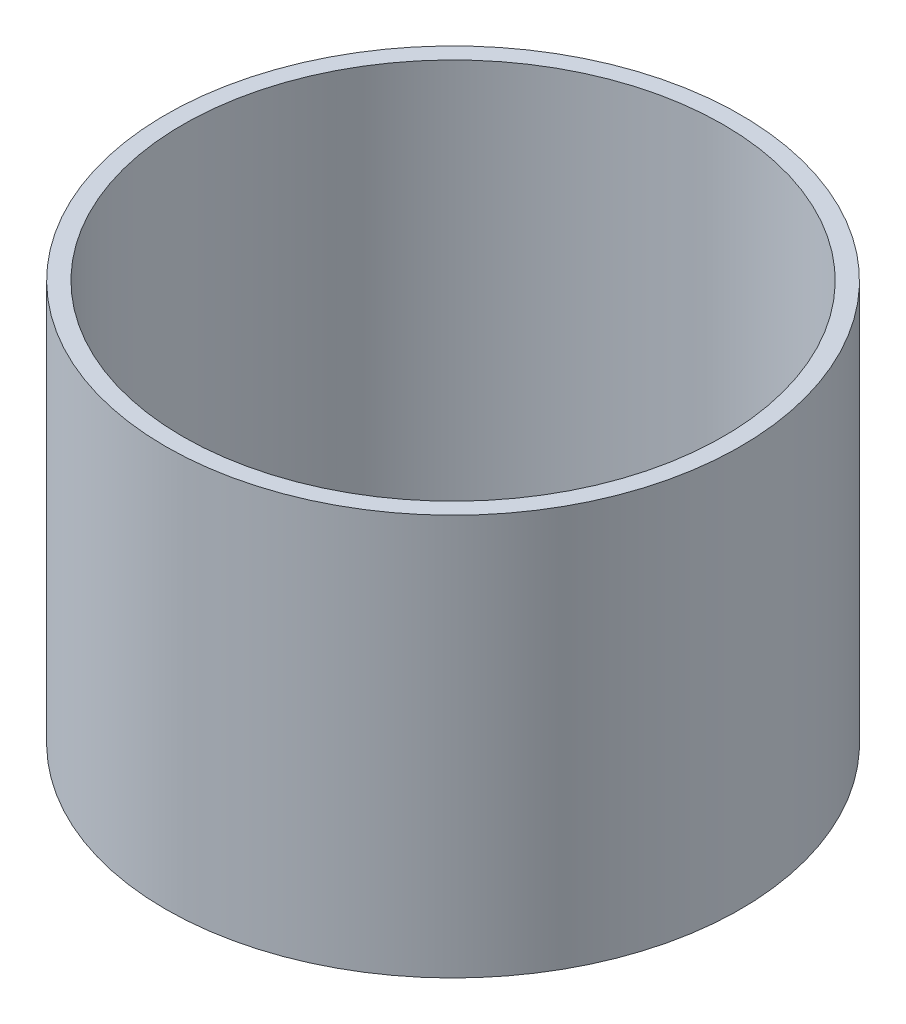
ISO-10303-21;
HEADER;
FILE_DESCRIPTION(('STEP AP214'),'2;1');
FILE_NAME('part.step','',(''),(''),'','','');
FILE_SCHEMA(('AUTOMOTIVE_DESIGN { 1 0 10303 214 1 1 1 1 }'));
ENDSEC;
DATA;
#1=APPLICATION_CONTEXT('core data for automotive mechanical design processes');
#2=APPLICATION_PROTOCOL_DEFINITION('international standard','automotive_design',2000,#1);
#3=PRODUCT_CONTEXT('',#1,'mechanical');
#4=PRODUCT('Part','Part','',(#3));
#5=PRODUCT_RELATED_PRODUCT_CATEGORY('part','',(#4));
#6=PRODUCT_DEFINITION_FORMATION('','',#4);
#7=PRODUCT_DEFINITION_CONTEXT('part definition',#1,'design');
#8=PRODUCT_DEFINITION('design','',#6,#7);
#9=PRODUCT_DEFINITION_SHAPE('','',#8);
#10=(LENGTH_UNIT() NAMED_UNIT(*) SI_UNIT(.MILLI.,.METRE.));
#11=(NAMED_UNIT(*) PLANE_ANGLE_UNIT() SI_UNIT($,.RADIAN.));
#12=(NAMED_UNIT(*) SI_UNIT($,.STERADIAN.) SOLID_ANGLE_UNIT());
#13=UNCERTAINTY_MEASURE_WITH_UNIT(LENGTH_MEASURE(1.E-05),#10,'distance_accuracy_value','');
#14=(GEOMETRIC_REPRESENTATION_CONTEXT(3) GLOBAL_UNCERTAINTY_ASSIGNED_CONTEXT((#13)) GLOBAL_UNIT_ASSIGNED_CONTEXT((#10,
#11,#12)) REPRESENTATION_CONTEXT('',''));
#15=CARTESIAN_POINT('',(0.,0.,0.));
#16=DIRECTION('',(0.,0.,1.));
#17=DIRECTION('',(1.,0.,0.));
#18=AXIS2_PLACEMENT_3D('',#15,#16,#17);
#19=CARTESIAN_POINT('',(0.,70.,0.));
#20=DIRECTION('',(0.,1.,0.));
#21=DIRECTION('',(0.,0.,1.));
#22=AXIS2_PLACEMENT_3D('',#19,#20,#21);
#23=PLANE('',#22);
#24=CARTESIAN_POINT('',(0.,70.,0.));
#25=DIRECTION('',(0.,1.,0.));
#26=DIRECTION('',(0.,0.,1.));
#27=AXIS2_PLACEMENT_3D('',#24,#25,#26);
#28=CIRCLE('',#27,50.2);
#29=CARTESIAN_POINT('',(0.,70.,50.2));
#30=VERTEX_POINT('',#29);
#31=EDGE_CURVE('E10',#30,#30,#28,.T.);
#32=ORIENTED_EDGE('',*,*,#31,.T.);
#33=EDGE_LOOP('',(#32));
#34=FACE_BOUND('',#33,.T.);
#35=CARTESIAN_POINT('',(0.,70.,0.));
#36=DIRECTION('',(0.,1.,0.));
#37=DIRECTION('',(0.,0.,1.));
#38=AXIS2_PLACEMENT_3D('',#35,#36,#37);
#39=CIRCLE('',#38,47.2);
#40=CARTESIAN_POINT('',(0.,70.,47.2));
#41=VERTEX_POINT('',#40);
#42=EDGE_CURVE('E50',#41,#41,#39,.T.);
#43=ORIENTED_EDGE('',*,*,#42,.F.);
#44=EDGE_LOOP('',(#43));
#45=FACE_BOUND('',#44,.T.);
#46=ADVANCED_FACE('F37',(#34,#45),#23,.T.);
#47=CARTESIAN_POINT('',(0.,0.,0.));
#48=DIRECTION('',(0.,1.,0.));
#49=DIRECTION('',(0.,0.,1.));
#50=AXIS2_PLACEMENT_3D('',#47,#48,#49);
#51=PLANE('',#50);
#52=CARTESIAN_POINT('',(0.,0.,0.));
#53=DIRECTION('',(0.,1.,0.));
#54=DIRECTION('',(0.,0.,1.));
#55=AXIS2_PLACEMENT_3D('',#52,#53,#54);
#56=CIRCLE('',#55,50.2);
#57=CARTESIAN_POINT('',(0.,0.,50.2));
#58=VERTEX_POINT('',#57);
#59=EDGE_CURVE('E41',#58,#58,#56,.T.);
#60=ORIENTED_EDGE('',*,*,#59,.F.);
#61=EDGE_LOOP('',(#60));
#62=FACE_BOUND('',#61,.T.);
#63=CARTESIAN_POINT('',(0.,0.,0.));
#64=DIRECTION('',(0.,1.,0.));
#65=DIRECTION('',(0.,0.,1.));
#66=AXIS2_PLACEMENT_3D('',#63,#64,#65);
#67=CIRCLE('',#66,47.2);
#68=CARTESIAN_POINT('',(0.,0.,47.2));
#69=VERTEX_POINT('',#68);
#70=EDGE_CURVE('E52',#69,#69,#67,.T.);
#71=ORIENTED_EDGE('',*,*,#70,.T.);
#72=EDGE_LOOP('',(#71));
#73=FACE_BOUND('',#72,.T.);
#74=ADVANCED_FACE('F64',(#62,#73),#51,.F.);
#75=CARTESIAN_POINT('',(0.,70.,0.));
#76=DIRECTION('',(0.,-1.,0.));
#77=DIRECTION('',(0.,0.,-1.));
#78=AXIS2_PLACEMENT_3D('',#75,#76,#77);
#79=CYLINDRICAL_SURFACE('',#78,50.2);
#80=ORIENTED_EDGE('',*,*,#31,.F.);
#81=EDGE_LOOP('',(#80));
#82=FACE_BOUND('',#81,.T.);
#83=ORIENTED_EDGE('',*,*,#59,.T.);
#84=EDGE_LOOP('',(#83));
#85=FACE_BOUND('',#84,.T.);
#86=ADVANCED_FACE('F39',(#82,#85),#79,.T.);
#87=CARTESIAN_POINT('',(0.,70.,0.));
#88=DIRECTION('',(0.,-1.,0.));
#89=DIRECTION('',(0.,0.,-1.));
#90=AXIS2_PLACEMENT_3D('',#87,#88,#89);
#91=CYLINDRICAL_SURFACE('',#90,47.2);
#92=ORIENTED_EDGE('',*,*,#42,.T.);
#93=EDGE_LOOP('',(#92));
#94=FACE_BOUND('',#93,.T.);
#95=ORIENTED_EDGE('',*,*,#70,.F.);
#96=EDGE_LOOP('',(#95));
#97=FACE_BOUND('',#96,.T.);
#98=ADVANCED_FACE('F60',(#94,#97),#91,.F.);
#99=CLOSED_SHELL('',(#46,#74,#86,#98));
#100=MANIFOLD_SOLID_BREP('B2',#99);
#101=ADVANCED_BREP_SHAPE_REPRESENTATION('',(#18,#100),#14);
#102=SHAPE_DEFINITION_REPRESENTATION(#9,#101);
ENDSEC;
END-ISO-10303-21;
